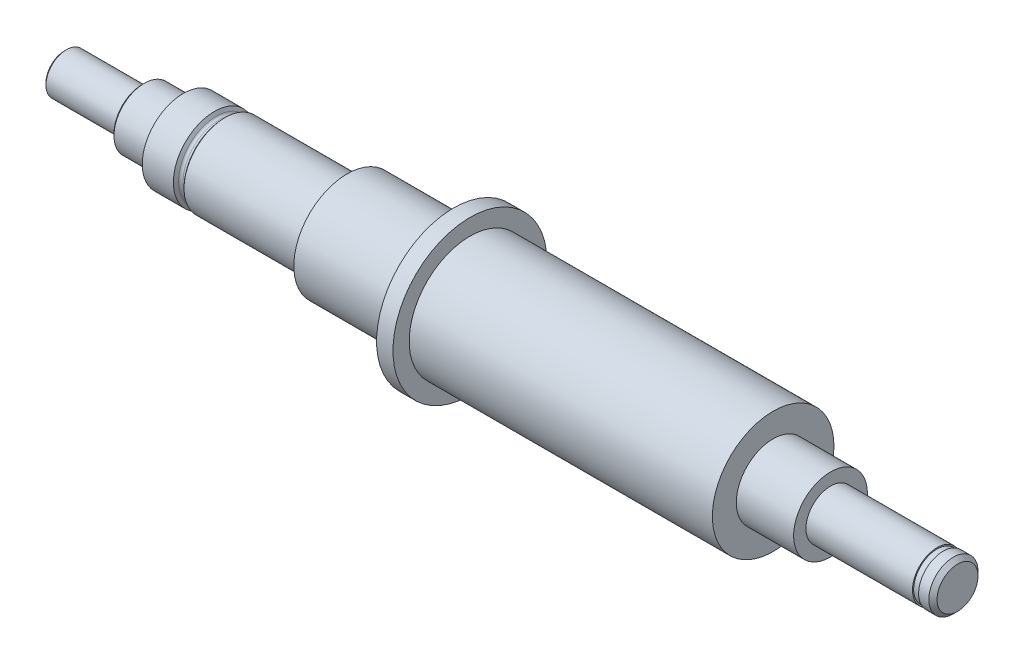
ISO-10303-21;
HEADER;
FILE_DESCRIPTION(('STEP AP214'),'2;1');
FILE_NAME('part.step','',(''),(''),'','','');
FILE_SCHEMA(('AUTOMOTIVE_DESIGN { 1 0 10303 214 1 1 1 1 }'));
ENDSEC;
DATA;
#1=APPLICATION_CONTEXT('core data for automotive mechanical design processes');
#2=APPLICATION_PROTOCOL_DEFINITION('international standard','automotive_design',2000,#1);
#3=PRODUCT_CONTEXT('',#1,'mechanical');
#4=PRODUCT('Part','Part','',(#3));
#5=PRODUCT_RELATED_PRODUCT_CATEGORY('part','',(#4));
#6=PRODUCT_DEFINITION_FORMATION('','',#4);
#7=PRODUCT_DEFINITION_CONTEXT('part definition',#1,'design');
#8=PRODUCT_DEFINITION('design','',#6,#7);
#9=PRODUCT_DEFINITION_SHAPE('','',#8);
#10=(LENGTH_UNIT() NAMED_UNIT(*) SI_UNIT(.MILLI.,.METRE.));
#11=(NAMED_UNIT(*) PLANE_ANGLE_UNIT() SI_UNIT($,.RADIAN.));
#12=(NAMED_UNIT(*) SI_UNIT($,.STERADIAN.) SOLID_ANGLE_UNIT());
#13=UNCERTAINTY_MEASURE_WITH_UNIT(LENGTH_MEASURE(1.E-05),#10,'distance_accuracy_value','');
#14=(GEOMETRIC_REPRESENTATION_CONTEXT(3) GLOBAL_UNCERTAINTY_ASSIGNED_CONTEXT((#13)) GLOBAL_UNIT_ASSIGNED_CONTEXT((#10,
#11,#12)) REPRESENTATION_CONTEXT('',''));
#15=CARTESIAN_POINT('',(0.,0.,0.));
#16=DIRECTION('',(0.,0.,1.));
#17=DIRECTION('',(1.,0.,0.));
#18=AXIS2_PLACEMENT_3D('',#15,#16,#17);
#19=CARTESIAN_POINT('',(-30.9690598923242,0.,0.));
#20=DIRECTION('',(-1.,0.,0.));
#21=DIRECTION('',(0.,0.,0.999999999999996));
#22=AXIS2_PLACEMENT_3D('',#19,#20,#21);
#23=CONICAL_SURFACE('',#22,4.6,1.04719755119662);
#24=CARTESIAN_POINT('',(-31.2,0.,0.));
#25=DIRECTION('',(1.,0.,0.));
#26=DIRECTION('',(0.,0.,-0.999999999999996));
#27=AXIS2_PLACEMENT_3D('',#24,#25,#26);
#28=CIRCLE('',#27,5.);
#29=CARTESIAN_POINT('',(-31.2,0.,-4.99999999999998));
#30=VERTEX_POINT('',#29);
#31=EDGE_CURVE('E11',#30,#30,#28,.T.);
#32=ORIENTED_EDGE('',*,*,#31,.T.);
#33=EDGE_LOOP('',(#32));
#34=FACE_BOUND('',#33,.T.);
#35=CARTESIAN_POINT('',(-30.9690598923242,0.,0.));
#36=DIRECTION('',(1.,0.,0.));
#37=DIRECTION('',(0.,0.,-0.999999999999996));
#38=AXIS2_PLACEMENT_3D('',#35,#36,#37);
#39=CIRCLE('',#38,4.6);
#40=CARTESIAN_POINT('',(-30.9690598923242,0.,-4.59999999999998));
#41=VERTEX_POINT('',#40);
#42=EDGE_CURVE('E72',#41,#41,#39,.T.);
#43=ORIENTED_EDGE('',*,*,#42,.F.);
#44=EDGE_LOOP('',(#43));
#45=FACE_BOUND('',#44,.T.);
#46=ADVANCED_FACE('F51',(#34,#45),#23,.T.);
#47=CARTESIAN_POINT('',(88.99,0.,0.));
#48=DIRECTION('',(1.,0.,0.));
#49=DIRECTION('',(0.,0.,-0.999999999999996));
#50=AXIS2_PLACEMENT_3D('',#47,#48,#49);
#51=CYLINDRICAL_SURFACE('',#50,5.);
#52=CARTESIAN_POINT('',(-35.,0.,0.));
#53=DIRECTION('',(1.,0.,0.));
#54=DIRECTION('',(0.,0.,-0.999999999999996));
#55=AXIS2_PLACEMENT_3D('',#52,#53,#54);
#56=CIRCLE('',#55,5.);
#57=CARTESIAN_POINT('',(-35.,0.,-4.99999999999998));
#58=VERTEX_POINT('',#57);
#59=EDGE_CURVE('E58',#58,#58,#56,.T.);
#60=ORIENTED_EDGE('',*,*,#59,.T.);
#61=EDGE_LOOP('',(#60));
#62=FACE_BOUND('',#61,.T.);
#63=ORIENTED_EDGE('',*,*,#31,.F.);
#64=EDGE_LOOP('',(#63));
#65=FACE_BOUND('',#64,.T.);
#66=ADVANCED_FACE('F207',(#62,#65),#51,.T.);
#67=CARTESIAN_POINT('',(-35.,0.,0.));
#68=DIRECTION('',(1.,0.,0.));
#69=DIRECTION('',(0.,0.,-0.999999999999996));
#70=AXIS2_PLACEMENT_3D('',#67,#68,#69);
#71=CONICAL_SURFACE('',#70,5.,1.0471975511966);
#72=CARTESIAN_POINT('',(-35.4330127018922,0.,0.));
#73=DIRECTION('',(1.,0.,0.));
#74=DIRECTION('',(0.,0.,-0.999999999999996));
#75=AXIS2_PLACEMENT_3D('',#72,#73,#74);
#76=CIRCLE('',#75,4.25);
#77=CARTESIAN_POINT('',(-35.4330127018922,0.,-4.24999999999998));
#78=VERTEX_POINT('',#77);
#79=EDGE_CURVE('E198',#78,#78,#76,.T.);
#80=ORIENTED_EDGE('',*,*,#79,.T.);
#81=EDGE_LOOP('',(#80));
#82=FACE_BOUND('',#81,.T.);
#83=ORIENTED_EDGE('',*,*,#59,.F.);
#84=EDGE_LOOP('',(#83));
#85=FACE_BOUND('',#84,.T.);
#86=ADVANCED_FACE('F210',(#82,#85),#71,.T.);
#87=CARTESIAN_POINT('',(-35.4330127018922,4.25,0.));
#88=DIRECTION('',(-1.,0.,0.));
#89=DIRECTION('',(0.,0.,0.999999999999996));
#90=AXIS2_PLACEMENT_3D('',#87,#88,#89);
#91=PLANE('',#90);
#92=CARTESIAN_POINT('',(-35.4330127018922,0.,0.));
#93=DIRECTION('',(1.,0.,0.));
#94=DIRECTION('',(0.,0.,-0.999999999999996));
#95=AXIS2_PLACEMENT_3D('',#92,#93,#94);
#96=CIRCLE('',#95,3.95);
#97=CARTESIAN_POINT('',(-35.4330127018922,0.,-3.94999999999998));
#98=VERTEX_POINT('',#97);
#99=EDGE_CURVE('E194',#98,#98,#96,.T.);
#100=ORIENTED_EDGE('',*,*,#99,.T.);
#101=EDGE_LOOP('',(#100));
#102=FACE_BOUND('',#101,.T.);
#103=ORIENTED_EDGE('',*,*,#79,.F.);
#104=EDGE_LOOP('',(#103));
#105=FACE_BOUND('',#104,.T.);
#106=ADVANCED_FACE('F212',(#102,#105),#91,.T.);
#107=CARTESIAN_POINT('',(-35.6830127018922,0.,0.));
#108=DIRECTION('',(1.,0.,0.));
#109=DIRECTION('',(0.,0.,-0.999999999999996));
#110=AXIS2_PLACEMENT_3D('',#107,#108,#109);
#111=TOROIDAL_SURFACE('',#110,3.95,0.25);
#112=CARTESIAN_POINT('',(-35.6830127018922,0.,0.));
#113=DIRECTION('',(1.,0.,0.));
#114=DIRECTION('',(0.,0.,-0.999999999999996));
#115=AXIS2_PLACEMENT_3D('',#112,#113,#114);
#116=CIRCLE('',#115,3.7);
#117=CARTESIAN_POINT('',(-35.6830127018922,0.,-3.69999999999998));
#118=VERTEX_POINT('',#117);
#119=EDGE_CURVE('E190',#118,#118,#116,.T.);
#120=ORIENTED_EDGE('',*,*,#119,.T.);
#121=EDGE_LOOP('',(#120));
#122=FACE_BOUND('',#121,.T.);
#123=ORIENTED_EDGE('',*,*,#99,.F.);
#124=EDGE_LOOP('',(#123));
#125=FACE_BOUND('',#124,.T.);
#126=ADVANCED_FACE('F219',(#122,#125),#111,.F.);
#127=CARTESIAN_POINT('',(88.99,0.,0.));
#128=DIRECTION('',(1.,0.,0.));
#129=DIRECTION('',(0.,0.,-0.999999999999996));
#130=AXIS2_PLACEMENT_3D('',#127,#128,#129);
#131=CYLINDRICAL_SURFACE('',#130,3.7);
#132=CARTESIAN_POINT('',(-39.75,0.,0.));
#133=DIRECTION('',(1.,0.,0.));
#134=DIRECTION('',(0.,0.,-0.999999999999996));
#135=AXIS2_PLACEMENT_3D('',#132,#133,#134);
#136=CIRCLE('',#135,3.7);
#137=CARTESIAN_POINT('',(-39.75,0.,-3.69999999999998));
#138=VERTEX_POINT('',#137);
#139=EDGE_CURVE('E186',#138,#138,#136,.T.);
#140=ORIENTED_EDGE('',*,*,#139,.T.);
#141=EDGE_LOOP('',(#140));
#142=FACE_BOUND('',#141,.T.);
#143=ORIENTED_EDGE('',*,*,#119,.F.);
#144=EDGE_LOOP('',(#143));
#145=FACE_BOUND('',#144,.T.);
#146=ADVANCED_FACE('F380',(#142,#145),#131,.T.);
#147=CARTESIAN_POINT('',(-39.75,0.,0.));
#148=DIRECTION('',(1.,0.,0.));
#149=DIRECTION('',(0.,0.,-0.999999999999996));
#150=AXIS2_PLACEMENT_3D('',#147,#148,#149);
#151=CONICAL_SURFACE('',#150,3.7,0.785398163397447);
#152=CARTESIAN_POINT('',(-40.,0.,0.));
#153=DIRECTION('',(1.,0.,0.));
#154=DIRECTION('',(0.,0.,-0.999999999999996));
#155=AXIS2_PLACEMENT_3D('',#152,#153,#154);
#156=CIRCLE('',#155,3.45);
#157=CARTESIAN_POINT('',(-40.,0.,-3.44999999999999));
#158=VERTEX_POINT('',#157);
#159=EDGE_CURVE('E182',#158,#158,#156,.T.);
#160=ORIENTED_EDGE('',*,*,#159,.T.);
#161=EDGE_LOOP('',(#160));
#162=FACE_BOUND('',#161,.T.);
#163=ORIENTED_EDGE('',*,*,#139,.F.);
#164=EDGE_LOOP('',(#163));
#165=FACE_BOUND('',#164,.T.);
#166=ADVANCED_FACE('F376',(#162,#165),#151,.T.);
#167=CARTESIAN_POINT('',(-40.,3.44999999999999,0.));
#168=DIRECTION('',(-1.,0.,0.));
#169=DIRECTION('',(0.,0.,0.999999999999996));
#170=AXIS2_PLACEMENT_3D('',#167,#168,#169);
#171=PLANE('',#170);
#172=CARTESIAN_POINT('',(-40.,0.,0.));
#173=DIRECTION('',(1.,0.,0.));
#174=DIRECTION('',(0.,0.,-0.999999999999996));
#175=AXIS2_PLACEMENT_3D('',#172,#173,#174);
#176=CIRCLE('',#175,2.5);
#177=CARTESIAN_POINT('',(-40.,0.,-2.49999999999999));
#178=VERTEX_POINT('',#177);
#179=EDGE_CURVE('E178',#178,#178,#176,.T.);
#180=ORIENTED_EDGE('',*,*,#179,.T.);
#181=EDGE_LOOP('',(#180));
#182=FACE_BOUND('',#181,.T.);
#183=ORIENTED_EDGE('',*,*,#159,.F.);
#184=EDGE_LOOP('',(#183));
#185=FACE_BOUND('',#184,.T.);
#186=ADVANCED_FACE('F372',(#182,#185),#171,.T.);
#187=CARTESIAN_POINT('',(88.99,0.,0.));
#188=DIRECTION('',(1.,0.,0.));
#189=DIRECTION('',(0.,0.,-0.999999999999996));
#190=AXIS2_PLACEMENT_3D('',#187,#188,#189);
#191=CYLINDRICAL_SURFACE('',#190,2.5);
#192=CARTESIAN_POINT('',(-49.25,0.,0.));
#193=DIRECTION('',(1.,0.,0.));
#194=DIRECTION('',(0.,0.,-0.999999999999996));
#195=AXIS2_PLACEMENT_3D('',#192,#193,#194);
#196=CIRCLE('',#195,2.5);
#197=CARTESIAN_POINT('',(-49.25,0.,-2.49999999999999));
#198=VERTEX_POINT('',#197);
#199=EDGE_CURVE('E174',#198,#198,#196,.T.);
#200=ORIENTED_EDGE('',*,*,#199,.T.);
#201=EDGE_LOOP('',(#200));
#202=FACE_BOUND('',#201,.T.);
#203=ORIENTED_EDGE('',*,*,#179,.F.);
#204=EDGE_LOOP('',(#203));
#205=FACE_BOUND('',#204,.T.);
#206=ADVANCED_FACE('F368',(#202,#205),#191,.T.);
#207=CARTESIAN_POINT('',(-49.25,0.,0.));
#208=DIRECTION('',(1.,0.,0.));
#209=DIRECTION('',(0.,0.,-0.999999999999996));
#210=AXIS2_PLACEMENT_3D('',#207,#208,#209);
#211=CONICAL_SURFACE('',#210,2.5,0.785398163397448);
#212=CARTESIAN_POINT('',(-49.5,0.,0.));
#213=DIRECTION('',(1.,0.,0.));
#214=DIRECTION('',(0.,0.,-0.999999999999996));
#215=AXIS2_PLACEMENT_3D('',#212,#213,#214);
#216=CIRCLE('',#215,2.25);
#217=CARTESIAN_POINT('',(-49.5,0.,-2.24999999999999));
#218=VERTEX_POINT('',#217);
#219=EDGE_CURVE('E170',#218,#218,#216,.T.);
#220=ORIENTED_EDGE('',*,*,#219,.T.);
#221=EDGE_LOOP('',(#220));
#222=FACE_BOUND('',#221,.T.);
#223=ORIENTED_EDGE('',*,*,#199,.F.);
#224=EDGE_LOOP('',(#223));
#225=FACE_BOUND('',#224,.T.);
#226=ADVANCED_FACE('F362',(#222,#225),#211,.T.);
#227=CARTESIAN_POINT('',(-49.5,2.24999999999999,0.));
#228=DIRECTION('',(-1.,0.,0.));
#229=DIRECTION('',(0.,0.,0.999999999999996));
#230=AXIS2_PLACEMENT_3D('',#227,#228,#229);
#231=PLANE('',#230);
#232=CARTESIAN_POINT('',(-49.5,0.,0.));
#233=DIRECTION('',(-1.,0.,0.));
#234=DIRECTION('',(0.,0.,0.999999999999996));
#235=AXIS2_PLACEMENT_3D('',#232,#233,#234);
#236=CIRCLE('',#235,1.525);
#237=CARTESIAN_POINT('',(-49.5,0.,1.52499999999999));
#238=VERTEX_POINT('',#237);
#239=EDGE_CURVE('E83',#238,#238,#236,.T.);
#240=ORIENTED_EDGE('',*,*,#239,.F.);
#241=EDGE_LOOP('',(#240));
#242=FACE_BOUND('',#241,.T.);
#243=ORIENTED_EDGE('',*,*,#219,.F.);
#244=EDGE_LOOP('',(#243));
#245=FACE_BOUND('',#244,.T.);
#246=ADVANCED_FACE('F357',(#242,#245),#231,.T.);
#247=CARTESIAN_POINT('',(59.5,2.49999999999999,0.));
#248=DIRECTION('',(1.,0.,0.));
#249=DIRECTION('',(0.,0.,-0.999999999999996));
#250=AXIS2_PLACEMENT_3D('',#247,#248,#249);
#251=PLANE('',#250);
#252=CARTESIAN_POINT('',(59.5,0.,0.));
#253=DIRECTION('',(1.,0.,0.));
#254=DIRECTION('',(0.,0.,-0.999999999999996));
#255=AXIS2_PLACEMENT_3D('',#252,#253,#254);
#256=CIRCLE('',#255,2.5);
#257=CARTESIAN_POINT('',(59.5,0.,-2.49999999999999));
#258=VERTEX_POINT('',#257);
#259=EDGE_CURVE('E166',#258,#258,#256,.T.);
#260=ORIENTED_EDGE('',*,*,#259,.T.);
#261=EDGE_LOOP('',(#260));
#262=FACE_BOUND('',#261,.T.);
#263=ADVANCED_FACE('F352',(#262),#251,.T.);
#264=CARTESIAN_POINT('',(59.5,0.,0.));
#265=DIRECTION('',(-1.,0.,0.));
#266=DIRECTION('',(0.,0.,0.999999999999996));
#267=AXIS2_PLACEMENT_3D('',#264,#265,#266);
#268=CONICAL_SURFACE('',#267,2.5,0.785398163397446);
#269=CARTESIAN_POINT('',(59.,0.,0.));
#270=DIRECTION('',(1.,0.,0.));
#271=DIRECTION('',(0.,0.,-0.999999999999996));
#272=AXIS2_PLACEMENT_3D('',#269,#270,#271);
#273=CIRCLE('',#272,3.);
#274=CARTESIAN_POINT('',(59.,0.,-2.99999999999999));
#275=VERTEX_POINT('',#274);
#276=EDGE_CURVE('E162',#275,#275,#273,.T.);
#277=ORIENTED_EDGE('',*,*,#276,.T.);
#278=EDGE_LOOP('',(#277));
#279=FACE_BOUND('',#278,.T.);
#280=ORIENTED_EDGE('',*,*,#259,.F.);
#281=EDGE_LOOP('',(#280));
#282=FACE_BOUND('',#281,.T.);
#283=ADVANCED_FACE('F346',(#279,#282),#268,.T.);
#284=CARTESIAN_POINT('',(88.99,0.,0.));
#285=DIRECTION('',(1.,0.,0.));
#286=DIRECTION('',(0.,0.,-0.999999999999996));
#287=AXIS2_PLACEMENT_3D('',#284,#285,#286);
#288=CYLINDRICAL_SURFACE('',#287,3.);
#289=CARTESIAN_POINT('',(57.75,0.,0.));
#290=DIRECTION('',(1.,0.,0.));
#291=DIRECTION('',(0.,0.,-0.999999999999996));
#292=AXIS2_PLACEMENT_3D('',#289,#290,#291);
#293=CIRCLE('',#292,3.);
#294=CARTESIAN_POINT('',(57.75,0.,-2.99999999999999));
#295=VERTEX_POINT('',#294);
#296=EDGE_CURVE('E158',#295,#295,#293,.T.);
#297=ORIENTED_EDGE('',*,*,#296,.T.);
#298=EDGE_LOOP('',(#297));
#299=FACE_BOUND('',#298,.T.);
#300=ORIENTED_EDGE('',*,*,#276,.F.);
#301=EDGE_LOOP('',(#300));
#302=FACE_BOUND('',#301,.T.);
#303=ADVANCED_FACE('F340',(#299,#302),#288,.T.);
#304=CARTESIAN_POINT('',(57.75,2.84999999999999,0.));
#305=DIRECTION('',(-1.,0.,0.));
#306=DIRECTION('',(0.,0.,0.999999999999996));
#307=AXIS2_PLACEMENT_3D('',#304,#305,#306);
#308=PLANE('',#307);
#309=CARTESIAN_POINT('',(57.75,0.,0.));
#310=DIRECTION('',(1.,0.,0.));
#311=DIRECTION('',(0.,0.,-0.999999999999996));
#312=AXIS2_PLACEMENT_3D('',#309,#310,#311);
#313=CIRCLE('',#312,2.85);
#314=CARTESIAN_POINT('',(57.75,0.,-2.84999999999999));
#315=VERTEX_POINT('',#314);
#316=EDGE_CURVE('E154',#315,#315,#313,.T.);
#317=ORIENTED_EDGE('',*,*,#316,.T.);
#318=EDGE_LOOP('',(#317));
#319=FACE_BOUND('',#318,.T.);
#320=ORIENTED_EDGE('',*,*,#296,.F.);
#321=EDGE_LOOP('',(#320));
#322=FACE_BOUND('',#321,.T.);
#323=ADVANCED_FACE('F334',(#319,#322),#308,.T.);
#324=CARTESIAN_POINT('',(88.99,0.,0.));
#325=DIRECTION('',(1.,0.,0.));
#326=DIRECTION('',(0.,0.,-0.999999999999996));
#327=AXIS2_PLACEMENT_3D('',#324,#325,#326);
#328=CYLINDRICAL_SURFACE('',#327,2.85);
#329=CARTESIAN_POINT('',(57.,0.,0.));
#330=DIRECTION('',(1.,0.,0.));
#331=DIRECTION('',(0.,0.,-0.999999999999996));
#332=AXIS2_PLACEMENT_3D('',#329,#330,#331);
#333=CIRCLE('',#332,2.85);
#334=CARTESIAN_POINT('',(57.,0.,-2.84999999999999));
#335=VERTEX_POINT('',#334);
#336=EDGE_CURVE('E150',#335,#335,#333,.T.);
#337=ORIENTED_EDGE('',*,*,#336,.T.);
#338=EDGE_LOOP('',(#337));
#339=FACE_BOUND('',#338,.T.);
#340=ORIENTED_EDGE('',*,*,#316,.F.);
#341=EDGE_LOOP('',(#340));
#342=FACE_BOUND('',#341,.T.);
#343=ADVANCED_FACE('F328',(#339,#342),#328,.T.);
#344=CARTESIAN_POINT('',(57.,2.99999999999999,0.));
#345=DIRECTION('',(1.,0.,0.));
#346=DIRECTION('',(0.,0.,-0.999999999999996));
#347=AXIS2_PLACEMENT_3D('',#344,#345,#346);
#348=PLANE('',#347);
#349=CARTESIAN_POINT('',(57.,0.,0.));
#350=DIRECTION('',(1.,0.,0.));
#351=DIRECTION('',(0.,0.,-0.999999999999996));
#352=AXIS2_PLACEMENT_3D('',#349,#350,#351);
#353=CIRCLE('',#352,3.);
#354=CARTESIAN_POINT('',(57.,0.,-2.99999999999999));
#355=VERTEX_POINT('',#354);
#356=EDGE_CURVE('E146',#355,#355,#353,.T.);
#357=ORIENTED_EDGE('',*,*,#356,.T.);
#358=EDGE_LOOP('',(#357));
#359=FACE_BOUND('',#358,.T.);
#360=ORIENTED_EDGE('',*,*,#336,.F.);
#361=EDGE_LOOP('',(#360));
#362=FACE_BOUND('',#361,.T.);
#363=ADVANCED_FACE('F322',(#359,#362),#348,.T.);
#364=CARTESIAN_POINT('',(88.99,0.,0.));
#365=DIRECTION('',(1.,0.,0.));
#366=DIRECTION('',(0.,0.,-0.999999999999996));
#367=AXIS2_PLACEMENT_3D('',#364,#365,#366);
#368=CYLINDRICAL_SURFACE('',#367,3.);
#369=CARTESIAN_POINT('',(44.,0.,0.));
#370=DIRECTION('',(1.,0.,0.));
#371=DIRECTION('',(0.,0.,-0.999999999999996));
#372=AXIS2_PLACEMENT_3D('',#369,#370,#371);
#373=CIRCLE('',#372,3.);
#374=CARTESIAN_POINT('',(44.,0.,-2.99999999999999));
#375=VERTEX_POINT('',#374);
#376=EDGE_CURVE('E142',#375,#375,#373,.T.);
#377=ORIENTED_EDGE('',*,*,#376,.T.);
#378=EDGE_LOOP('',(#377));
#379=FACE_BOUND('',#378,.T.);
#380=ORIENTED_EDGE('',*,*,#356,.F.);
#381=EDGE_LOOP('',(#380));
#382=FACE_BOUND('',#381,.T.);
#383=ADVANCED_FACE('F316',(#379,#382),#368,.T.);
#384=CARTESIAN_POINT('',(44.,2.99999999999999,0.));
#385=DIRECTION('',(1.,0.,0.));
#386=DIRECTION('',(0.,0.,-0.999999999999996));
#387=AXIS2_PLACEMENT_3D('',#384,#385,#386);
#388=PLANE('',#387);
#389=CARTESIAN_POINT('',(44.,0.,0.));
#390=DIRECTION('',(1.,0.,0.));
#391=DIRECTION('',(0.,0.,-0.999999999999996));
#392=AXIS2_PLACEMENT_3D('',#389,#390,#391);
#393=CIRCLE('',#392,4.5);
#394=CARTESIAN_POINT('',(44.,0.,-4.49999999999998));
#395=VERTEX_POINT('',#394);
#396=EDGE_CURVE('E138',#395,#395,#393,.T.);
#397=ORIENTED_EDGE('',*,*,#396,.T.);
#398=EDGE_LOOP('',(#397));
#399=FACE_BOUND('',#398,.T.);
#400=ORIENTED_EDGE('',*,*,#376,.F.);
#401=EDGE_LOOP('',(#400));
#402=FACE_BOUND('',#401,.T.);
#403=ADVANCED_FACE('F310',(#399,#402),#388,.T.);
#404=CARTESIAN_POINT('',(88.99,0.,0.));
#405=DIRECTION('',(1.,0.,0.));
#406=DIRECTION('',(0.,0.,-0.999999999999996));
#407=AXIS2_PLACEMENT_3D('',#404,#405,#406);
#408=CYLINDRICAL_SURFACE('',#407,4.5);
#409=CARTESIAN_POINT('',(37.,0.,0.));
#410=DIRECTION('',(1.,0.,0.));
#411=DIRECTION('',(0.,0.,-0.999999999999996));
#412=AXIS2_PLACEMENT_3D('',#409,#410,#411);
#413=CIRCLE('',#412,4.5);
#414=CARTESIAN_POINT('',(37.,0.,-4.49999999999998));
#415=VERTEX_POINT('',#414);
#416=EDGE_CURVE('E134',#415,#415,#413,.T.);
#417=ORIENTED_EDGE('',*,*,#416,.T.);
#418=EDGE_LOOP('',(#417));
#419=FACE_BOUND('',#418,.T.);
#420=ORIENTED_EDGE('',*,*,#396,.F.);
#421=EDGE_LOOP('',(#420));
#422=FACE_BOUND('',#421,.T.);
#423=ADVANCED_FACE('F304',(#419,#422),#408,.T.);
#424=CARTESIAN_POINT('',(37.,7.41999999999997,0.));
#425=DIRECTION('',(1.,0.,0.));
#426=DIRECTION('',(0.,0.,-0.999999999999996));
#427=AXIS2_PLACEMENT_3D('',#424,#425,#426);
#428=PLANE('',#427);
#429=CARTESIAN_POINT('',(37.,0.,0.));
#430=DIRECTION('',(1.,0.,0.));
#431=DIRECTION('',(0.,0.,-0.999999999999996));
#432=AXIS2_PLACEMENT_3D('',#429,#430,#431);
#433=CIRCLE('',#432,7.42);
#434=CARTESIAN_POINT('',(37.,0.,-7.41999999999997));
#435=VERTEX_POINT('',#434);
#436=EDGE_CURVE('E130',#435,#435,#433,.T.);
#437=ORIENTED_EDGE('',*,*,#436,.T.);
#438=EDGE_LOOP('',(#437));
#439=FACE_BOUND('',#438,.T.);
#440=ORIENTED_EDGE('',*,*,#416,.F.);
#441=EDGE_LOOP('',(#440));
#442=FACE_BOUND('',#441,.T.);
#443=ADVANCED_FACE('F298',(#439,#442),#428,.T.);
#444=CARTESIAN_POINT('',(88.99,0.,0.));
#445=DIRECTION('',(1.,0.,0.));
#446=DIRECTION('',(0.,0.,-0.999999999999996));
#447=AXIS2_PLACEMENT_3D('',#444,#445,#446);
#448=CYLINDRICAL_SURFACE('',#447,7.42);
#449=CARTESIAN_POINT('',(0.,0.,0.));
#450=DIRECTION('',(1.,0.,0.));
#451=DIRECTION('',(0.,0.,-0.999999999999996));
#452=AXIS2_PLACEMENT_3D('',#449,#450,#451);
#453=CIRCLE('',#452,7.42);
#454=CARTESIAN_POINT('',(0.,0.,-7.41999999999997));
#455=VERTEX_POINT('',#454);
#456=EDGE_CURVE('E126',#455,#455,#453,.T.);
#457=ORIENTED_EDGE('',*,*,#456,.T.);
#458=EDGE_LOOP('',(#457));
#459=FACE_BOUND('',#458,.T.);
#460=ORIENTED_EDGE('',*,*,#436,.F.);
#461=EDGE_LOOP('',(#460));
#462=FACE_BOUND('',#461,.T.);
#463=ADVANCED_FACE('F292',(#459,#462),#448,.T.);
#464=CARTESIAN_POINT('',(0.,9.39999999999996,0.));
#465=DIRECTION('',(1.,0.,0.));
#466=DIRECTION('',(0.,0.,-0.999999999999996));
#467=AXIS2_PLACEMENT_3D('',#464,#465,#466);
#468=PLANE('',#467);
#469=CARTESIAN_POINT('',(0.,0.,0.));
#470=DIRECTION('',(1.,0.,0.));
#471=DIRECTION('',(0.,0.,-0.999999999999996));
#472=AXIS2_PLACEMENT_3D('',#469,#470,#471);
#473=CIRCLE('',#472,9.4);
#474=CARTESIAN_POINT('',(0.,0.,-9.39999999999996));
#475=VERTEX_POINT('',#474);
#476=EDGE_CURVE('E122',#475,#475,#473,.T.);
#477=ORIENTED_EDGE('',*,*,#476,.T.);
#478=EDGE_LOOP('',(#477));
#479=FACE_BOUND('',#478,.T.);
#480=ORIENTED_EDGE('',*,*,#456,.F.);
#481=EDGE_LOOP('',(#480));
#482=FACE_BOUND('',#481,.T.);
#483=ADVANCED_FACE('F286',(#479,#482),#468,.T.);
#484=CARTESIAN_POINT('',(88.99,0.,0.));
#485=DIRECTION('',(1.,0.,0.));
#486=DIRECTION('',(0.,0.,-0.999999999999996));
#487=AXIS2_PLACEMENT_3D('',#484,#485,#486);
#488=CYLINDRICAL_SURFACE('',#487,9.4);
#489=CARTESIAN_POINT('',(-2.,0.,0.));
#490=DIRECTION('',(1.,0.,0.));
#491=DIRECTION('',(0.,0.,-0.999999999999996));
#492=AXIS2_PLACEMENT_3D('',#489,#490,#491);
#493=CIRCLE('',#492,9.4);
#494=CARTESIAN_POINT('',(-2.,0.,-9.39999999999996));
#495=VERTEX_POINT('',#494);
#496=EDGE_CURVE('E118',#495,#495,#493,.T.);
#497=ORIENTED_EDGE('',*,*,#496,.T.);
#498=EDGE_LOOP('',(#497));
#499=FACE_BOUND('',#498,.T.);
#500=ORIENTED_EDGE('',*,*,#476,.F.);
#501=EDGE_LOOP('',(#500));
#502=FACE_BOUND('',#501,.T.);
#503=ADVANCED_FACE('F280',(#499,#502),#488,.T.);
#504=CARTESIAN_POINT('',(-2.,6.49999999999999,0.));
#505=DIRECTION('',(-1.,0.,0.));
#506=DIRECTION('',(0.,0.,0.999999999999996));
#507=AXIS2_PLACEMENT_3D('',#504,#505,#506);
#508=PLANE('',#507);
#509=CARTESIAN_POINT('',(-2.,0.,0.));
#510=DIRECTION('',(1.,0.,0.));
#511=DIRECTION('',(0.,0.,-0.999999999999996));
#512=AXIS2_PLACEMENT_3D('',#509,#510,#511);
#513=CIRCLE('',#512,6.5);
#514=CARTESIAN_POINT('',(-2.,0.,-6.49999999999997));
#515=VERTEX_POINT('',#514);
#516=EDGE_CURVE('E114',#515,#515,#513,.T.);
#517=ORIENTED_EDGE('',*,*,#516,.T.);
#518=EDGE_LOOP('',(#517));
#519=FACE_BOUND('',#518,.T.);
#520=ORIENTED_EDGE('',*,*,#496,.F.);
#521=EDGE_LOOP('',(#520));
#522=FACE_BOUND('',#521,.T.);
#523=ADVANCED_FACE('F274',(#519,#522),#508,.T.);
#524=CARTESIAN_POINT('',(88.99,0.,0.));
#525=DIRECTION('',(1.,0.,0.));
#526=DIRECTION('',(0.,0.,-0.999999999999996));
#527=AXIS2_PLACEMENT_3D('',#524,#525,#526);
#528=CYLINDRICAL_SURFACE('',#527,6.5);
#529=CARTESIAN_POINT('',(-15.,0.,0.));
#530=DIRECTION('',(1.,0.,0.));
#531=DIRECTION('',(0.,0.,-0.999999999999996));
#532=AXIS2_PLACEMENT_3D('',#529,#530,#531);
#533=CIRCLE('',#532,6.5);
#534=CARTESIAN_POINT('',(-15.,0.,-6.49999999999997));
#535=VERTEX_POINT('',#534);
#536=EDGE_CURVE('E110',#535,#535,#533,.T.);
#537=ORIENTED_EDGE('',*,*,#536,.T.);
#538=EDGE_LOOP('',(#537));
#539=FACE_BOUND('',#538,.T.);
#540=ORIENTED_EDGE('',*,*,#516,.F.);
#541=EDGE_LOOP('',(#540));
#542=FACE_BOUND('',#541,.T.);
#543=ADVANCED_FACE('F268',(#539,#542),#528,.T.);
#544=CARTESIAN_POINT('',(-15.,4.99999999999999,0.));
#545=DIRECTION('',(-1.,0.,0.));
#546=DIRECTION('',(0.,0.,0.999999999999996));
#547=AXIS2_PLACEMENT_3D('',#544,#545,#546);
#548=PLANE('',#547);
#549=CARTESIAN_POINT('',(-15.,0.,0.));
#550=DIRECTION('',(1.,0.,0.));
#551=DIRECTION('',(0.,0.,-0.999999999999996));
#552=AXIS2_PLACEMENT_3D('',#549,#550,#551);
#553=CIRCLE('',#552,5.);
#554=CARTESIAN_POINT('',(-15.,0.,-4.99999999999998));
#555=VERTEX_POINT('',#554);
#556=EDGE_CURVE('E106',#555,#555,#553,.T.);
#557=ORIENTED_EDGE('',*,*,#556,.T.);
#558=EDGE_LOOP('',(#557));
#559=FACE_BOUND('',#558,.T.);
#560=ORIENTED_EDGE('',*,*,#536,.F.);
#561=EDGE_LOOP('',(#560));
#562=FACE_BOUND('',#561,.T.);
#563=ADVANCED_FACE('F262',(#559,#562),#548,.T.);
#564=CARTESIAN_POINT('',(88.99,0.,0.));
#565=DIRECTION('',(1.,0.,0.));
#566=DIRECTION('',(0.,0.,-0.999999999999996));
#567=AXIS2_PLACEMENT_3D('',#564,#565,#566);
#568=CYLINDRICAL_SURFACE('',#567,5.);
#569=CARTESIAN_POINT('',(-29.9,0.,0.));
#570=DIRECTION('',(1.,0.,0.));
#571=DIRECTION('',(0.,0.,-0.999999999999996));
#572=AXIS2_PLACEMENT_3D('',#569,#570,#571);
#573=CIRCLE('',#572,5.);
#574=CARTESIAN_POINT('',(-29.9,0.,-4.99999999999998));
#575=VERTEX_POINT('',#574);
#576=EDGE_CURVE('E102',#575,#575,#573,.T.);
#577=ORIENTED_EDGE('',*,*,#576,.T.);
#578=EDGE_LOOP('',(#577));
#579=FACE_BOUND('',#578,.T.);
#580=ORIENTED_EDGE('',*,*,#556,.F.);
#581=EDGE_LOOP('',(#580));
#582=FACE_BOUND('',#581,.T.);
#583=ADVANCED_FACE('F256',(#579,#582),#568,.T.);
#584=CARTESIAN_POINT('',(-29.9,0.,0.));
#585=DIRECTION('',(1.,0.,0.));
#586=DIRECTION('',(0.,0.,-0.999999999999996));
#587=AXIS2_PLACEMENT_3D('',#584,#585,#586);
#588=CONICAL_SURFACE('',#587,5.,0.785398163397435);
#589=CARTESIAN_POINT('',(-30.,0.,0.));
#590=DIRECTION('',(1.,0.,0.));
#591=DIRECTION('',(0.,0.,-0.999999999999996));
#592=AXIS2_PLACEMENT_3D('',#589,#590,#591);
#593=CIRCLE('',#592,4.9);
#594=CARTESIAN_POINT('',(-30.,0.,-4.89999999999998));
#595=VERTEX_POINT('',#594);
#596=EDGE_CURVE('E98',#595,#595,#593,.T.);
#597=ORIENTED_EDGE('',*,*,#596,.T.);
#598=EDGE_LOOP('',(#597));
#599=FACE_BOUND('',#598,.T.);
#600=ORIENTED_EDGE('',*,*,#576,.F.);
#601=EDGE_LOOP('',(#600));
#602=FACE_BOUND('',#601,.T.);
#603=ADVANCED_FACE('F250',(#599,#602),#588,.T.);
#604=CARTESIAN_POINT('',(-30.,4.8,0.));
#605=DIRECTION('',(-1.,0.,0.));
#606=DIRECTION('',(0.,0.,0.999999999999996));
#607=AXIS2_PLACEMENT_3D('',#604,#605,#606);
#608=PLANE('',#607);
#609=CARTESIAN_POINT('',(-30.,0.,0.));
#610=DIRECTION('',(1.,0.,0.));
#611=DIRECTION('',(0.,0.,-0.999999999999996));
#612=AXIS2_PLACEMENT_3D('',#609,#610,#611);
#613=CIRCLE('',#612,4.8);
#614=CARTESIAN_POINT('',(-30.,0.,-4.79999999999998));
#615=VERTEX_POINT('',#614);
#616=EDGE_CURVE('E94',#615,#615,#613,.T.);
#617=ORIENTED_EDGE('',*,*,#616,.T.);
#618=EDGE_LOOP('',(#617));
#619=FACE_BOUND('',#618,.T.);
#620=ORIENTED_EDGE('',*,*,#596,.F.);
#621=EDGE_LOOP('',(#620));
#622=FACE_BOUND('',#621,.T.);
#623=ADVANCED_FACE('F244',(#619,#622),#608,.T.);
#624=CARTESIAN_POINT('',(-30.4,0.,0.));
#625=DIRECTION('',(1.,0.,0.));
#626=DIRECTION('',(0.,0.,-0.999999999999996));
#627=AXIS2_PLACEMENT_3D('',#624,#625,#626);
#628=TOROIDAL_SURFACE('',#627,4.8,0.400000000000001);
#629=CARTESIAN_POINT('',(-30.4,0.,0.));
#630=DIRECTION('',(1.,0.,0.));
#631=DIRECTION('',(0.,0.,-0.999999999999996));
#632=AXIS2_PLACEMENT_3D('',#629,#630,#631);
#633=CIRCLE('',#632,4.4);
#634=CARTESIAN_POINT('',(-30.4,0.,-4.39999999999998));
#635=VERTEX_POINT('',#634);
#636=EDGE_CURVE('E90',#635,#635,#633,.T.);
#637=ORIENTED_EDGE('',*,*,#636,.T.);
#638=EDGE_LOOP('',(#637));
#639=FACE_BOUND('',#638,.T.);
#640=ORIENTED_EDGE('',*,*,#616,.F.);
#641=EDGE_LOOP('',(#640));
#642=FACE_BOUND('',#641,.T.);
#643=ADVANCED_FACE('F238',(#639,#642),#628,.F.);
#644=CARTESIAN_POINT('',(88.99,0.,0.));
#645=DIRECTION('',(1.,0.,0.));
#646=DIRECTION('',(0.,0.,-0.999999999999996));
#647=AXIS2_PLACEMENT_3D('',#644,#645,#646);
#648=CYLINDRICAL_SURFACE('',#647,4.4);
#649=CARTESIAN_POINT('',(-30.6226497308104,0.,0.));
#650=DIRECTION('',(1.,0.,0.));
#651=DIRECTION('',(0.,0.,-0.999999999999996));
#652=AXIS2_PLACEMENT_3D('',#649,#650,#651);
#653=CIRCLE('',#652,4.4);
#654=CARTESIAN_POINT('',(-30.6226497308104,0.,-4.39999999999998));
#655=VERTEX_POINT('',#654);
#656=EDGE_CURVE('E80',#655,#655,#653,.T.);
#657=ORIENTED_EDGE('',*,*,#656,.T.);
#658=EDGE_LOOP('',(#657));
#659=FACE_BOUND('',#658,.T.);
#660=ORIENTED_EDGE('',*,*,#636,.F.);
#661=EDGE_LOOP('',(#660));
#662=FACE_BOUND('',#661,.T.);
#663=ADVANCED_FACE('F232',(#659,#662),#648,.T.);
#664=CARTESIAN_POINT('',(-30.6226497308104,0.,0.));
#665=DIRECTION('',(1.,0.,0.));
#666=DIRECTION('',(0.,0.,-0.999999999999996));
#667=AXIS2_PLACEMENT_3D('',#664,#665,#666);
#668=TOROIDAL_SURFACE('',#667,4.8,0.400000000000002);
#669=ORIENTED_EDGE('',*,*,#42,.T.);
#670=EDGE_LOOP('',(#669));
#671=FACE_BOUND('',#670,.T.);
#672=ORIENTED_EDGE('',*,*,#656,.F.);
#673=EDGE_LOOP('',(#672));
#674=FACE_BOUND('',#673,.T.);
#675=ADVANCED_FACE('F65',(#671,#674),#668,.F.);
#676=CARTESIAN_POINT('',(-41.,0.,0.));
#677=DIRECTION('',(-1.,0.,0.));
#678=DIRECTION('',(0.,0.,0.999999999999996));
#679=AXIS2_PLACEMENT_3D('',#676,#677,#678);
#680=CONICAL_SURFACE('',#679,1.25,1.02974425867665);
#681=CARTESIAN_POINT('',(-40.2489242262155,0.,0.));
#682=VERTEX_POINT('',#681);
#683=VERTEX_LOOP('',#682);
#684=FACE_BOUND('',#683,.T.);
#685=CARTESIAN_POINT('',(-41.,0.,0.));
#686=DIRECTION('',(-1.,0.,0.));
#687=DIRECTION('',(0.,0.,0.999999999999996));
#688=AXIS2_PLACEMENT_3D('',#685,#686,#687);
#689=CIRCLE('',#688,1.25);
#690=CARTESIAN_POINT('',(-41.,0.,1.24999999999999));
#691=VERTEX_POINT('',#690);
#692=EDGE_CURVE('E69',#691,#691,#689,.T.);
#693=ORIENTED_EDGE('',*,*,#692,.T.);
#694=EDGE_LOOP('',(#693));
#695=FACE_BOUND('',#694,.T.);
#696=ADVANCED_FACE('F61',(#684,#695),#680,.F.);
#697=CARTESIAN_POINT('',(-49.5,0.,0.));
#698=DIRECTION('',(-1.,0.,0.));
#699=DIRECTION('',(0.,0.,0.999999999999996));
#700=AXIS2_PLACEMENT_3D('',#697,#698,#699);
#701=CYLINDRICAL_SURFACE('',#700,1.25);
#702=ORIENTED_EDGE('',*,*,#692,.F.);
#703=EDGE_LOOP('',(#702));
#704=FACE_BOUND('',#703,.T.);
#705=CARTESIAN_POINT('',(-49.3412286759729,0.,0.));
#706=DIRECTION('',(-1.,0.,0.));
#707=DIRECTION('',(0.,0.,0.999999999999996));
#708=AXIS2_PLACEMENT_3D('',#705,#706,#707);
#709=CIRCLE('',#708,1.25);
#710=CARTESIAN_POINT('',(-49.3412286759729,0.,1.24999999999999));
#711=VERTEX_POINT('',#710);
#712=EDGE_CURVE('E73',#711,#711,#709,.T.);
#713=ORIENTED_EDGE('',*,*,#712,.T.);
#714=EDGE_LOOP('',(#713));
#715=FACE_BOUND('',#714,.T.);
#716=ADVANCED_FACE('F64',(#704,#715),#701,.F.);
#717=CARTESIAN_POINT('',(-49.5,0.,0.));
#718=DIRECTION('',(-1.,0.,0.));
#719=DIRECTION('',(0.,0.,0.999999999999996));
#720=AXIS2_PLACEMENT_3D('',#717,#718,#719);
#721=CONICAL_SURFACE('',#720,1.525,1.0471975511966);
#722=ORIENTED_EDGE('',*,*,#712,.F.);
#723=EDGE_LOOP('',(#722));
#724=FACE_BOUND('',#723,.T.);
#725=ORIENTED_EDGE('',*,*,#239,.T.);
#726=EDGE_LOOP('',(#725));
#727=FACE_BOUND('',#726,.T.);
#728=ADVANCED_FACE('F433',(#724,#727),#721,.F.);
#729=CLOSED_SHELL('',(#46,#66,#86,#106,#126,#146,#166,#186,#206,#226,#246,#263,#283,#303,#323,
#343,#363,#383,#403,#423,#443,#463,#483,#503,#523,#543,#563,#583,#603,#623,#643,#663,#675,#696,
#716,#728));
#730=MANIFOLD_SOLID_BREP('B2',#729);
#731=ADVANCED_BREP_SHAPE_REPRESENTATION('',(#18,#730),#14);
#732=SHAPE_DEFINITION_REPRESENTATION(#9,#731);
ENDSEC;
END-ISO-10303-21;
